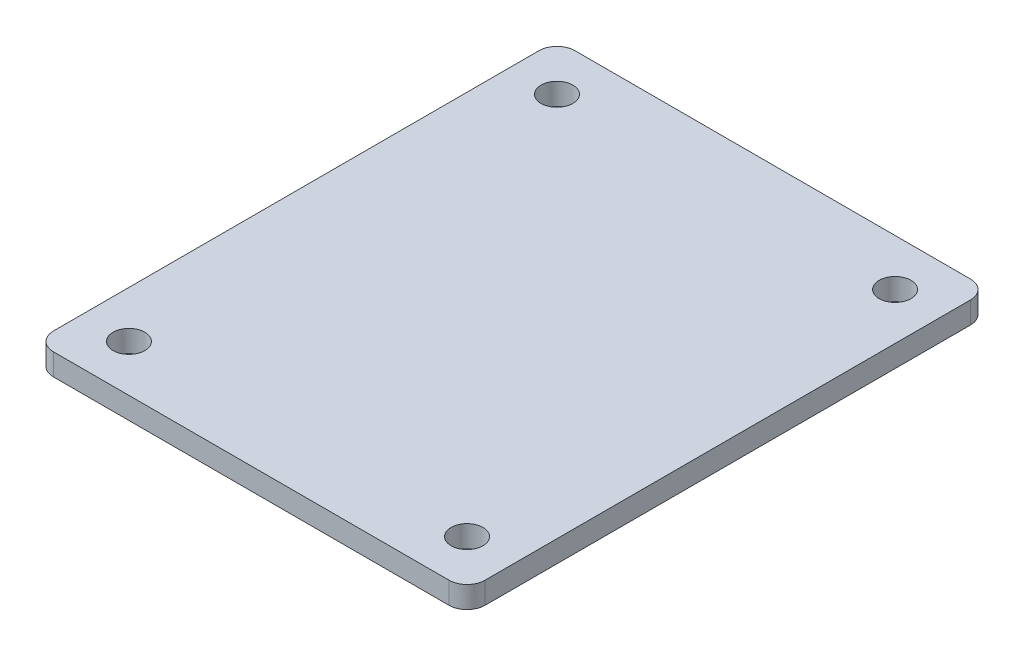
ISO-10303-21;
HEADER;
FILE_DESCRIPTION(('STEP AP214'),'2;1');
FILE_NAME('part.step','',(''),(''),'','','');
FILE_SCHEMA(('AUTOMOTIVE_DESIGN { 1 0 10303 214 1 1 1 1 }'));
ENDSEC;
DATA;
#1=APPLICATION_CONTEXT('core data for automotive mechanical design processes');
#2=APPLICATION_PROTOCOL_DEFINITION('international standard','automotive_design',2000,#1);
#3=PRODUCT_CONTEXT('',#1,'mechanical');
#4=PRODUCT('Part','Part','',(#3));
#5=PRODUCT_RELATED_PRODUCT_CATEGORY('part','',(#4));
#6=PRODUCT_DEFINITION_FORMATION('','',#4);
#7=PRODUCT_DEFINITION_CONTEXT('part definition',#1,'design');
#8=PRODUCT_DEFINITION('design','',#6,#7);
#9=PRODUCT_DEFINITION_SHAPE('','',#8);
#10=(LENGTH_UNIT() NAMED_UNIT(*) SI_UNIT(.MILLI.,.METRE.));
#11=(NAMED_UNIT(*) PLANE_ANGLE_UNIT() SI_UNIT($,.RADIAN.));
#12=(NAMED_UNIT(*) SI_UNIT($,.STERADIAN.) SOLID_ANGLE_UNIT());
#13=UNCERTAINTY_MEASURE_WITH_UNIT(LENGTH_MEASURE(1.E-05),#10,'distance_accuracy_value','');
#14=(GEOMETRIC_REPRESENTATION_CONTEXT(3) GLOBAL_UNCERTAINTY_ASSIGNED_CONTEXT((#13)) GLOBAL_UNIT_ASSIGNED_CONTEXT((#10,
#11,#12)) REPRESENTATION_CONTEXT('',''));
#15=CARTESIAN_POINT('',(0.,0.,0.));
#16=DIRECTION('',(0.,0.,1.));
#17=DIRECTION('',(1.,0.,0.));
#18=AXIS2_PLACEMENT_3D('',#15,#16,#17);
#19=CARTESIAN_POINT('',(0.,3.0734,0.));
#20=DIRECTION('',(1.,0.,0.));
#21=DIRECTION('',(0.,0.,-1.));
#22=AXIS2_PLACEMENT_3D('',#19,#20,#21);
#23=PLANE('',#22);
#24=DIRECTION('',(0.,0.,1.));
#25=VECTOR('',#24,1.);
#26=CARTESIAN_POINT('',(0.,3.0734,0.));
#27=LINE('',#26,#25);
#28=CARTESIAN_POINT('',(0.,3.0734,-71.12));
#29=VERTEX_POINT('',#28);
#30=CARTESIAN_POINT('',(0.,3.0734,-2.54));
#31=VERTEX_POINT('',#30);
#32=EDGE_CURVE('E124',#29,#31,#27,.T.);
#33=ORIENTED_EDGE('',*,*,#32,.F.);
#34=DIRECTION('',(0.,-1.,0.));
#35=VECTOR('',#34,1.);
#36=CARTESIAN_POINT('',(0.,3.0734,-71.12));
#37=LINE('',#36,#35);
#38=CARTESIAN_POINT('',(0.,0.,-71.12));
#39=VERTEX_POINT('',#38);
#40=EDGE_CURVE('E150',#29,#39,#37,.T.);
#41=ORIENTED_EDGE('',*,*,#40,.T.);
#42=DIRECTION('',(0.,0.,1.));
#43=VECTOR('',#42,1.);
#44=CARTESIAN_POINT('',(0.,0.,0.));
#45=LINE('',#44,#43);
#46=CARTESIAN_POINT('',(0.,0.,-2.54));
#47=VERTEX_POINT('',#46);
#48=EDGE_CURVE('E158',#39,#47,#45,.T.);
#49=ORIENTED_EDGE('',*,*,#48,.T.);
#50=DIRECTION('',(0.,-1.,0.));
#51=VECTOR('',#50,1.);
#52=CARTESIAN_POINT('',(0.,3.0734,-2.54));
#53=LINE('',#52,#51);
#54=EDGE_CURVE('E148',#47,#31,#53,.F.);
#55=ORIENTED_EDGE('',*,*,#54,.T.);
#56=EDGE_LOOP('',(#33,#41,#49,#55));
#57=FACE_BOUND('',#56,.T.);
#58=ADVANCED_FACE('F33',(#57),#23,.F.);
#59=CARTESIAN_POINT('',(0.,3.0734,0.));
#60=DIRECTION('',(0.,0.,-1.));
#61=DIRECTION('',(-1.,0.,0.));
#62=AXIS2_PLACEMENT_3D('',#59,#60,#61);
#63=PLANE('',#62);
#64=DIRECTION('',(1.,0.,0.));
#65=VECTOR('',#64,1.);
#66=CARTESIAN_POINT('',(0.,0.,0.));
#67=LINE('',#66,#65);
#68=CARTESIAN_POINT('',(2.54,0.,0.));
#69=VERTEX_POINT('',#68);
#70=CARTESIAN_POINT('',(58.42,0.,0.));
#71=VERTEX_POINT('',#70);
#72=EDGE_CURVE('E129',#69,#71,#67,.T.);
#73=ORIENTED_EDGE('',*,*,#72,.T.);
#74=DIRECTION('',(0.,-1.,0.));
#75=VECTOR('',#74,1.);
#76=CARTESIAN_POINT('',(58.42,3.0734,0.));
#77=LINE('',#76,#75);
#78=CARTESIAN_POINT('',(58.42,3.0734,0.));
#79=VERTEX_POINT('',#78);
#80=EDGE_CURVE('E11',#71,#79,#77,.F.);
#81=ORIENTED_EDGE('',*,*,#80,.T.);
#82=DIRECTION('',(1.,0.,0.));
#83=VECTOR('',#82,1.);
#84=CARTESIAN_POINT('',(0.,3.0734,0.));
#85=LINE('',#84,#83);
#86=CARTESIAN_POINT('',(2.54,3.0734,0.));
#87=VERTEX_POINT('',#86);
#88=EDGE_CURVE('E127',#87,#79,#85,.T.);
#89=ORIENTED_EDGE('',*,*,#88,.F.);
#90=DIRECTION('',(0.,-1.,0.));
#91=VECTOR('',#90,1.);
#92=CARTESIAN_POINT('',(2.54,3.0734,0.));
#93=LINE('',#92,#91);
#94=EDGE_CURVE('E41',#87,#69,#93,.T.);
#95=ORIENTED_EDGE('',*,*,#94,.T.);
#96=EDGE_LOOP('',(#73,#81,#89,#95));
#97=FACE_BOUND('',#96,.T.);
#98=ADVANCED_FACE('F155',(#97),#63,.F.);
#99=CARTESIAN_POINT('',(60.96,3.0734,0.));
#100=DIRECTION('',(-1.,0.,0.));
#101=DIRECTION('',(0.,0.,1.));
#102=AXIS2_PLACEMENT_3D('',#99,#100,#101);
#103=PLANE('',#102);
#104=DIRECTION('',(0.,0.,-1.));
#105=VECTOR('',#104,1.);
#106=CARTESIAN_POINT('',(60.96,0.,0.));
#107=LINE('',#106,#105);
#108=CARTESIAN_POINT('',(60.96,0.,-2.54));
#109=VERTEX_POINT('',#108);
#110=CARTESIAN_POINT('',(60.96,0.,-71.12));
#111=VERTEX_POINT('',#110);
#112=EDGE_CURVE('E125',#109,#111,#107,.T.);
#113=ORIENTED_EDGE('',*,*,#112,.T.);
#114=DIRECTION('',(0.,-1.,0.));
#115=VECTOR('',#114,1.);
#116=CARTESIAN_POINT('',(60.96,3.0734,-71.12));
#117=LINE('',#116,#115);
#118=CARTESIAN_POINT('',(60.96,3.0734,-71.12));
#119=VERTEX_POINT('',#118);
#120=EDGE_CURVE('E103',#111,#119,#117,.F.);
#121=ORIENTED_EDGE('',*,*,#120,.T.);
#122=DIRECTION('',(0.,0.,-1.));
#123=VECTOR('',#122,1.);
#124=CARTESIAN_POINT('',(60.96,3.0734,0.));
#125=LINE('',#124,#123);
#126=CARTESIAN_POINT('',(60.96,3.0734,-2.54));
#127=VERTEX_POINT('',#126);
#128=EDGE_CURVE('E163',#127,#119,#125,.T.);
#129=ORIENTED_EDGE('',*,*,#128,.F.);
#130=DIRECTION('',(0.,-1.,0.));
#131=VECTOR('',#130,1.);
#132=CARTESIAN_POINT('',(60.96,3.0734,-2.54));
#133=LINE('',#132,#131);
#134=EDGE_CURVE('E108',#127,#109,#133,.T.);
#135=ORIENTED_EDGE('',*,*,#134,.T.);
#136=EDGE_LOOP('',(#113,#121,#129,#135));
#137=FACE_BOUND('',#136,.T.);
#138=ADVANCED_FACE('F206',(#137),#103,.F.);
#139=CARTESIAN_POINT('',(0.,3.0734,-73.66));
#140=DIRECTION('',(0.,0.,1.));
#141=DIRECTION('',(1.,0.,0.));
#142=AXIS2_PLACEMENT_3D('',#139,#140,#141);
#143=PLANE('',#142);
#144=DIRECTION('',(-1.,0.,0.));
#145=VECTOR('',#144,1.);
#146=CARTESIAN_POINT('',(0.,3.0734,-73.66));
#147=LINE('',#146,#145);
#148=CARTESIAN_POINT('',(58.42,3.0734,-73.66));
#149=VERTEX_POINT('',#148);
#150=CARTESIAN_POINT('',(2.54,3.0734,-73.66));
#151=VERTEX_POINT('',#150);
#152=EDGE_CURVE('E118',#149,#151,#147,.T.);
#153=ORIENTED_EDGE('',*,*,#152,.F.);
#154=DIRECTION('',(0.,-1.,0.));
#155=VECTOR('',#154,1.);
#156=CARTESIAN_POINT('',(58.42,3.0734,-73.66));
#157=LINE('',#156,#155);
#158=CARTESIAN_POINT('',(58.42,0.,-73.66));
#159=VERTEX_POINT('',#158);
#160=EDGE_CURVE('E102',#149,#159,#157,.T.);
#161=ORIENTED_EDGE('',*,*,#160,.T.);
#162=DIRECTION('',(-1.,0.,0.));
#163=VECTOR('',#162,1.);
#164=CARTESIAN_POINT('',(0.,0.,-73.66));
#165=LINE('',#164,#163);
#166=CARTESIAN_POINT('',(2.54,0.,-73.66));
#167=VERTEX_POINT('',#166);
#168=EDGE_CURVE('E115',#159,#167,#165,.T.);
#169=ORIENTED_EDGE('',*,*,#168,.T.);
#170=DIRECTION('',(0.,-1.,0.));
#171=VECTOR('',#170,1.);
#172=CARTESIAN_POINT('',(2.54,3.0734,-73.66));
#173=LINE('',#172,#171);
#174=EDGE_CURVE('E120',#167,#151,#173,.F.);
#175=ORIENTED_EDGE('',*,*,#174,.T.);
#176=EDGE_LOOP('',(#153,#161,#169,#175));
#177=FACE_BOUND('',#176,.T.);
#178=ADVANCED_FACE('F114',(#177),#143,.F.);
#179=CARTESIAN_POINT('',(0.,3.0734,0.));
#180=DIRECTION('',(0.,-1.,0.));
#181=DIRECTION('',(0.,0.,-1.));
#182=AXIS2_PLACEMENT_3D('',#179,#180,#181);
#183=PLANE('',#182);
#184=CARTESIAN_POINT('',(54.356,3.0734,-67.056));
#185=DIRECTION('',(0.,1.,0.));
#186=DIRECTION('',(0.,0.,1.));
#187=AXIS2_PLACEMENT_3D('',#184,#185,#186);
#188=CIRCLE('',#187,2.24789999999998);
#189=CARTESIAN_POINT('',(54.356,3.0734,-64.8081));
#190=VERTEX_POINT('',#189);
#191=EDGE_CURVE('E187',#190,#190,#188,.T.);
#192=ORIENTED_EDGE('',*,*,#191,.F.);
#193=EDGE_LOOP('',(#192));
#194=FACE_BOUND('',#193,.T.);
#195=CARTESIAN_POINT('',(54.356,3.0734,-6.604));
#196=DIRECTION('',(0.,1.,0.));
#197=DIRECTION('',(0.,0.,1.));
#198=AXIS2_PLACEMENT_3D('',#195,#196,#197);
#199=CIRCLE('',#198,2.24789999999998);
#200=CARTESIAN_POINT('',(54.356,3.0734,-4.35610000000002));
#201=VERTEX_POINT('',#200);
#202=EDGE_CURVE('E181',#201,#201,#199,.T.);
#203=ORIENTED_EDGE('',*,*,#202,.F.);
#204=EDGE_LOOP('',(#203));
#205=FACE_BOUND('',#204,.T.);
#206=CARTESIAN_POINT('',(6.60399999999999,3.0734,-67.056));
#207=DIRECTION('',(0.,1.,0.));
#208=DIRECTION('',(0.,0.,1.));
#209=AXIS2_PLACEMENT_3D('',#206,#207,#208);
#210=CIRCLE('',#209,2.24789999999999);
#211=CARTESIAN_POINT('',(6.60399999999999,3.0734,-64.8081));
#212=VERTEX_POINT('',#211);
#213=EDGE_CURVE('E175',#212,#212,#210,.T.);
#214=ORIENTED_EDGE('',*,*,#213,.F.);
#215=EDGE_LOOP('',(#214));
#216=FACE_BOUND('',#215,.T.);
#217=CARTESIAN_POINT('',(6.60399999999999,3.0734,-6.604));
#218=DIRECTION('',(0.,1.,0.));
#219=DIRECTION('',(0.,0.,1.));
#220=AXIS2_PLACEMENT_3D('',#217,#218,#219);
#221=CIRCLE('',#220,2.24789999999999);
#222=CARTESIAN_POINT('',(6.60399999999999,3.0734,-4.35610000000001));
#223=VERTEX_POINT('',#222);
#224=EDGE_CURVE('E169',#223,#223,#221,.T.);
#225=ORIENTED_EDGE('',*,*,#224,.F.);
#226=EDGE_LOOP('',(#225));
#227=FACE_BOUND('',#226,.T.);
#228=ORIENTED_EDGE('',*,*,#128,.T.);
#229=CARTESIAN_POINT('',(58.42,3.0734,-71.12));
#230=DIRECTION('',(0.,-1.,0.));
#231=DIRECTION('',(0.,0.,-1.));
#232=AXIS2_PLACEMENT_3D('',#229,#230,#231);
#233=CIRCLE('',#232,2.54);
#234=EDGE_CURVE('E146',#119,#149,#233,.F.);
#235=ORIENTED_EDGE('',*,*,#234,.T.);
#236=ORIENTED_EDGE('',*,*,#152,.T.);
#237=CARTESIAN_POINT('',(2.54,3.0734,-71.12));
#238=DIRECTION('',(0.,-1.,0.));
#239=DIRECTION('',(0.,0.,-1.));
#240=AXIS2_PLACEMENT_3D('',#237,#238,#239);
#241=CIRCLE('',#240,2.54);
#242=EDGE_CURVE('E144',#151,#29,#241,.F.);
#243=ORIENTED_EDGE('',*,*,#242,.T.);
#244=ORIENTED_EDGE('',*,*,#32,.T.);
#245=CARTESIAN_POINT('',(2.54,3.0734,-2.54));
#246=DIRECTION('',(0.,-1.,0.));
#247=DIRECTION('',(0.,0.,-1.));
#248=AXIS2_PLACEMENT_3D('',#245,#246,#247);
#249=CIRCLE('',#248,2.54);
#250=EDGE_CURVE('E53',#31,#87,#249,.F.);
#251=ORIENTED_EDGE('',*,*,#250,.T.);
#252=ORIENTED_EDGE('',*,*,#88,.T.);
#253=CARTESIAN_POINT('',(58.42,3.0734,-2.54));
#254=DIRECTION('',(0.,-1.,0.));
#255=DIRECTION('',(0.,0.,-1.));
#256=AXIS2_PLACEMENT_3D('',#253,#254,#255);
#257=CIRCLE('',#256,2.54);
#258=EDGE_CURVE('E142',#79,#127,#257,.F.);
#259=ORIENTED_EDGE('',*,*,#258,.T.);
#260=EDGE_LOOP('',(#228,#235,#236,#243,#244,#251,#252,#259));
#261=FACE_BOUND('',#260,.T.);
#262=ADVANCED_FACE('F193',(#194,#205,#216,#227,#261),#183,.F.);
#263=CARTESIAN_POINT('',(0.,0.,0.));
#264=DIRECTION('',(0.,-1.,0.));
#265=DIRECTION('',(0.,0.,-1.));
#266=AXIS2_PLACEMENT_3D('',#263,#264,#265);
#267=PLANE('',#266);
#268=CARTESIAN_POINT('',(54.356,0.,-67.056));
#269=DIRECTION('',(0.,1.,0.));
#270=DIRECTION('',(0.,0.,1.));
#271=AXIS2_PLACEMENT_3D('',#268,#269,#270);
#272=CIRCLE('',#271,2.2479);
#273=CARTESIAN_POINT('',(54.356,0.,-64.8081));
#274=VERTEX_POINT('',#273);
#275=EDGE_CURVE('E184',#274,#274,#272,.T.);
#276=ORIENTED_EDGE('',*,*,#275,.T.);
#277=EDGE_LOOP('',(#276));
#278=FACE_BOUND('',#277,.T.);
#279=CARTESIAN_POINT('',(54.356,0.,-6.604));
#280=DIRECTION('',(0.,1.,0.));
#281=DIRECTION('',(0.,0.,1.));
#282=AXIS2_PLACEMENT_3D('',#279,#280,#281);
#283=CIRCLE('',#282,2.2479);
#284=CARTESIAN_POINT('',(54.356,0.,-4.3561));
#285=VERTEX_POINT('',#284);
#286=EDGE_CURVE('E178',#285,#285,#283,.T.);
#287=ORIENTED_EDGE('',*,*,#286,.T.);
#288=EDGE_LOOP('',(#287));
#289=FACE_BOUND('',#288,.T.);
#290=CARTESIAN_POINT('',(6.60399999999999,0.,-67.056));
#291=DIRECTION('',(0.,1.,0.));
#292=DIRECTION('',(0.,0.,1.));
#293=AXIS2_PLACEMENT_3D('',#290,#291,#292);
#294=CIRCLE('',#293,2.2479);
#295=CARTESIAN_POINT('',(6.60399999999999,0.,-64.8081));
#296=VERTEX_POINT('',#295);
#297=EDGE_CURVE('E172',#296,#296,#294,.T.);
#298=ORIENTED_EDGE('',*,*,#297,.T.);
#299=EDGE_LOOP('',(#298));
#300=FACE_BOUND('',#299,.T.);
#301=CARTESIAN_POINT('',(6.60399999999999,0.,-6.604));
#302=DIRECTION('',(0.,1.,0.));
#303=DIRECTION('',(0.,0.,1.));
#304=AXIS2_PLACEMENT_3D('',#301,#302,#303);
#305=CIRCLE('',#304,2.2479);
#306=CARTESIAN_POINT('',(6.60399999999999,0.,-4.3561));
#307=VERTEX_POINT('',#306);
#308=EDGE_CURVE('E159',#307,#307,#305,.T.);
#309=ORIENTED_EDGE('',*,*,#308,.T.);
#310=EDGE_LOOP('',(#309));
#311=FACE_BOUND('',#310,.T.);
#312=ORIENTED_EDGE('',*,*,#168,.F.);
#313=CARTESIAN_POINT('',(58.42,0.,-71.12));
#314=DIRECTION('',(0.,-1.,0.));
#315=DIRECTION('',(0.,0.,-1.));
#316=AXIS2_PLACEMENT_3D('',#313,#314,#315);
#317=CIRCLE('',#316,2.54);
#318=EDGE_CURVE('E98',#159,#111,#317,.T.);
#319=ORIENTED_EDGE('',*,*,#318,.T.);
#320=ORIENTED_EDGE('',*,*,#112,.F.);
#321=CARTESIAN_POINT('',(58.42,0.,-2.54));
#322=DIRECTION('',(0.,-1.,0.));
#323=DIRECTION('',(0.,0.,-1.));
#324=AXIS2_PLACEMENT_3D('',#321,#322,#323);
#325=CIRCLE('',#324,2.54);
#326=EDGE_CURVE('E135',#109,#71,#325,.T.);
#327=ORIENTED_EDGE('',*,*,#326,.T.);
#328=ORIENTED_EDGE('',*,*,#72,.F.);
#329=CARTESIAN_POINT('',(2.54,0.,-2.54));
#330=DIRECTION('',(0.,-1.,0.));
#331=DIRECTION('',(0.,0.,-1.));
#332=AXIS2_PLACEMENT_3D('',#329,#330,#331);
#333=CIRCLE('',#332,2.54);
#334=EDGE_CURVE('E119',#69,#47,#333,.T.);
#335=ORIENTED_EDGE('',*,*,#334,.T.);
#336=ORIENTED_EDGE('',*,*,#48,.F.);
#337=CARTESIAN_POINT('',(2.54,0.,-71.12));
#338=DIRECTION('',(0.,-1.,0.));
#339=DIRECTION('',(0.,0.,-1.));
#340=AXIS2_PLACEMENT_3D('',#337,#338,#339);
#341=CIRCLE('',#340,2.54);
#342=EDGE_CURVE('E109',#39,#167,#341,.T.);
#343=ORIENTED_EDGE('',*,*,#342,.T.);
#344=EDGE_LOOP('',(#312,#319,#320,#327,#328,#335,#336,#343));
#345=FACE_BOUND('',#344,.T.);
#346=ADVANCED_FACE('F122',(#278,#289,#300,#311,#345),#267,.T.);
#347=CARTESIAN_POINT('',(58.42,3.0734,-71.12));
#348=DIRECTION('',(0.,-1.,0.));
#349=DIRECTION('',(0.,0.,-1.));
#350=AXIS2_PLACEMENT_3D('',#347,#348,#349);
#351=CYLINDRICAL_SURFACE('',#350,2.54);
#352=ORIENTED_EDGE('',*,*,#234,.F.);
#353=ORIENTED_EDGE('',*,*,#120,.F.);
#354=ORIENTED_EDGE('',*,*,#318,.F.);
#355=ORIENTED_EDGE('',*,*,#160,.F.);
#356=EDGE_LOOP('',(#352,#353,#354,#355));
#357=FACE_BOUND('',#356,.T.);
#358=ADVANCED_FACE('F101',(#357),#351,.T.);
#359=CARTESIAN_POINT('',(2.54,3.0734,-71.12));
#360=DIRECTION('',(0.,-1.,0.));
#361=DIRECTION('',(0.,0.,-1.));
#362=AXIS2_PLACEMENT_3D('',#359,#360,#361);
#363=CYLINDRICAL_SURFACE('',#362,2.54);
#364=ORIENTED_EDGE('',*,*,#242,.F.);
#365=ORIENTED_EDGE('',*,*,#174,.F.);
#366=ORIENTED_EDGE('',*,*,#342,.F.);
#367=ORIENTED_EDGE('',*,*,#40,.F.);
#368=EDGE_LOOP('',(#364,#365,#366,#367));
#369=FACE_BOUND('',#368,.T.);
#370=ADVANCED_FACE('F210',(#369),#363,.T.);
#371=CARTESIAN_POINT('',(58.42,3.0734,-2.54));
#372=DIRECTION('',(0.,-1.,0.));
#373=DIRECTION('',(0.,0.,-1.));
#374=AXIS2_PLACEMENT_3D('',#371,#372,#373);
#375=CYLINDRICAL_SURFACE('',#374,2.54);
#376=ORIENTED_EDGE('',*,*,#258,.F.);
#377=ORIENTED_EDGE('',*,*,#80,.F.);
#378=ORIENTED_EDGE('',*,*,#326,.F.);
#379=ORIENTED_EDGE('',*,*,#134,.F.);
#380=EDGE_LOOP('',(#376,#377,#378,#379));
#381=FACE_BOUND('',#380,.T.);
#382=ADVANCED_FACE('F208',(#381),#375,.T.);
#383=CARTESIAN_POINT('',(2.54,3.0734,-2.54));
#384=DIRECTION('',(0.,-1.,0.));
#385=DIRECTION('',(0.,0.,-1.));
#386=AXIS2_PLACEMENT_3D('',#383,#384,#385);
#387=CYLINDRICAL_SURFACE('',#386,2.54);
#388=ORIENTED_EDGE('',*,*,#250,.F.);
#389=ORIENTED_EDGE('',*,*,#54,.F.);
#390=ORIENTED_EDGE('',*,*,#334,.F.);
#391=ORIENTED_EDGE('',*,*,#94,.F.);
#392=EDGE_LOOP('',(#388,#389,#390,#391));
#393=FACE_BOUND('',#392,.T.);
#394=ADVANCED_FACE('F35',(#393),#387,.T.);
#395=CARTESIAN_POINT('',(6.60399999999999,3.0734,-6.604));
#396=DIRECTION('',(0.,1.,0.));
#397=DIRECTION('',(0.,0.,1.));
#398=AXIS2_PLACEMENT_3D('',#395,#396,#397);
#399=CYLINDRICAL_SURFACE('',#398,2.24789999999999);
#400=ORIENTED_EDGE('',*,*,#308,.F.);
#401=EDGE_LOOP('',(#400));
#402=FACE_BOUND('',#401,.T.);
#403=ORIENTED_EDGE('',*,*,#224,.T.);
#404=EDGE_LOOP('',(#403));
#405=FACE_BOUND('',#404,.T.);
#406=ADVANCED_FACE('F215',(#402,#405),#399,.F.);
#407=CARTESIAN_POINT('',(6.60399999999999,3.0734,-67.056));
#408=DIRECTION('',(0.,1.,0.));
#409=DIRECTION('',(0.,0.,1.));
#410=AXIS2_PLACEMENT_3D('',#407,#408,#409);
#411=CYLINDRICAL_SURFACE('',#410,2.24789999999999);
#412=ORIENTED_EDGE('',*,*,#297,.F.);
#413=EDGE_LOOP('',(#412));
#414=FACE_BOUND('',#413,.T.);
#415=ORIENTED_EDGE('',*,*,#213,.T.);
#416=EDGE_LOOP('',(#415));
#417=FACE_BOUND('',#416,.T.);
#418=ADVANCED_FACE('F270',(#414,#417),#411,.F.);
#419=CARTESIAN_POINT('',(54.356,3.0734,-6.604));
#420=DIRECTION('',(0.,1.,0.));
#421=DIRECTION('',(0.,0.,1.));
#422=AXIS2_PLACEMENT_3D('',#419,#420,#421);
#423=CYLINDRICAL_SURFACE('',#422,2.24789999999999);
#424=ORIENTED_EDGE('',*,*,#286,.F.);
#425=EDGE_LOOP('',(#424));
#426=FACE_BOUND('',#425,.T.);
#427=ORIENTED_EDGE('',*,*,#202,.T.);
#428=EDGE_LOOP('',(#427));
#429=FACE_BOUND('',#428,.T.);
#430=ADVANCED_FACE('F279',(#426,#429),#423,.F.);
#431=CARTESIAN_POINT('',(54.356,3.0734,-67.056));
#432=DIRECTION('',(0.,1.,0.));
#433=DIRECTION('',(0.,0.,1.));
#434=AXIS2_PLACEMENT_3D('',#431,#432,#433);
#435=CYLINDRICAL_SURFACE('',#434,2.24789999999999);
#436=ORIENTED_EDGE('',*,*,#275,.F.);
#437=EDGE_LOOP('',(#436));
#438=FACE_BOUND('',#437,.T.);
#439=ORIENTED_EDGE('',*,*,#191,.T.);
#440=EDGE_LOOP('',(#439));
#441=FACE_BOUND('',#440,.T.);
#442=ADVANCED_FACE('F191',(#438,#441),#435,.F.);
#443=CLOSED_SHELL('',(#58,#98,#138,#178,#262,#346,#358,#370,#382,#394,#406,#418,#430,#442));
#444=MANIFOLD_SOLID_BREP('B2',#443);
#445=ADVANCED_BREP_SHAPE_REPRESENTATION('',(#18,#444),#14);
#446=SHAPE_DEFINITION_REPRESENTATION(#9,#445);
ENDSEC;
END-ISO-10303-21;
